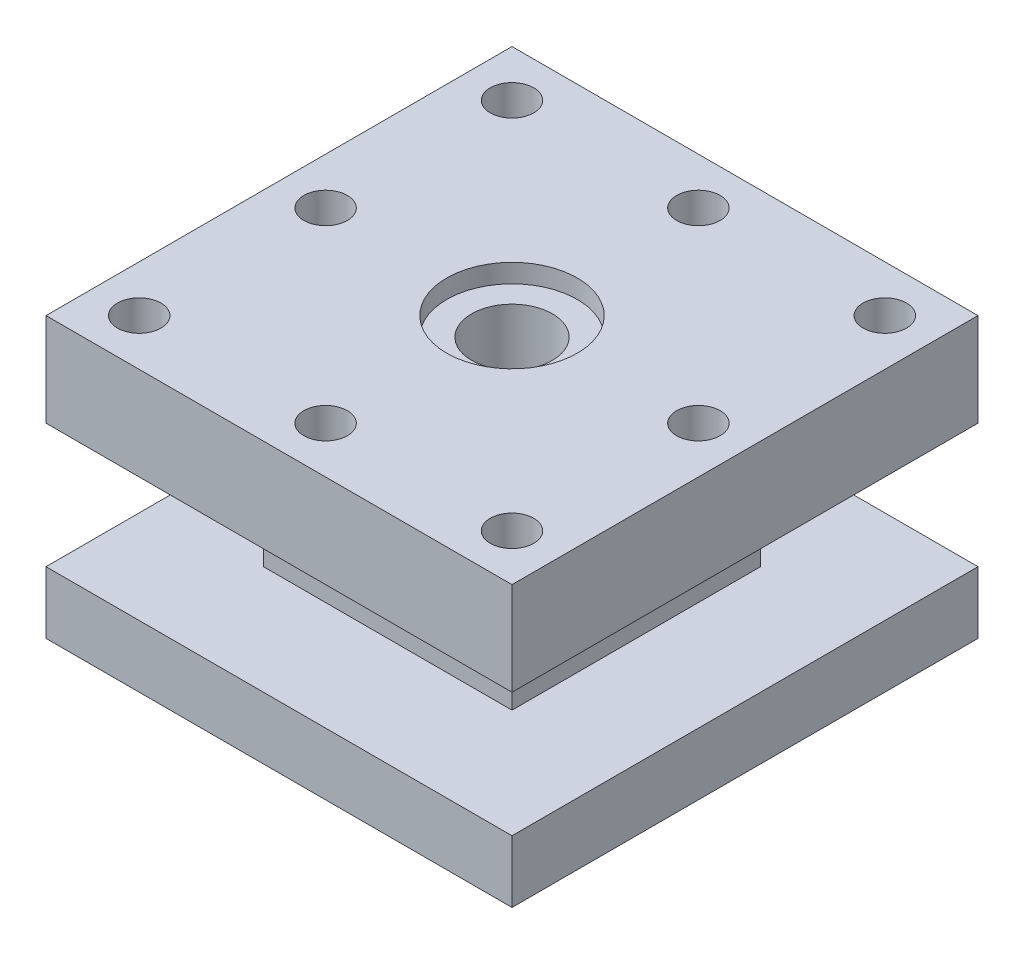
ISO-10303-21;
HEADER;
FILE_DESCRIPTION(('STEP AP214'),'2;1');
FILE_NAME('part.step','',(''),(''),'','','');
FILE_SCHEMA(('AUTOMOTIVE_DESIGN { 1 0 10303 214 1 1 1 1 }'));
ENDSEC;
DATA;
#1=APPLICATION_CONTEXT('core data for automotive mechanical design processes');
#2=APPLICATION_PROTOCOL_DEFINITION('international standard','automotive_design',2000,#1);
#3=PRODUCT_CONTEXT('',#1,'mechanical');
#4=PRODUCT('Part','Part','',(#3));
#5=PRODUCT_RELATED_PRODUCT_CATEGORY('part','',(#4));
#6=PRODUCT_DEFINITION_FORMATION('','',#4);
#7=PRODUCT_DEFINITION_CONTEXT('part definition',#1,'design');
#8=PRODUCT_DEFINITION('design','',#6,#7);
#9=PRODUCT_DEFINITION_SHAPE('','',#8);
#10=(LENGTH_UNIT() NAMED_UNIT(*) SI_UNIT(.MILLI.,.METRE.));
#11=(NAMED_UNIT(*) PLANE_ANGLE_UNIT() SI_UNIT($,.RADIAN.));
#12=(NAMED_UNIT(*) SI_UNIT($,.STERADIAN.) SOLID_ANGLE_UNIT());
#13=UNCERTAINTY_MEASURE_WITH_UNIT(LENGTH_MEASURE(1.E-05),#10,'distance_accuracy_value','');
#14=(GEOMETRIC_REPRESENTATION_CONTEXT(3) GLOBAL_UNCERTAINTY_ASSIGNED_CONTEXT((#13)) GLOBAL_UNIT_ASSIGNED_CONTEXT((#10,
#11,#12)) REPRESENTATION_CONTEXT('',''));
#15=CARTESIAN_POINT('',(0.,0.,0.));
#16=DIRECTION('',(0.,0.,1.));
#17=DIRECTION('',(1.,0.,0.));
#18=AXIS2_PLACEMENT_3D('',#15,#16,#17);
#19=CARTESIAN_POINT('',(0.,90.,0.));
#20=DIRECTION('',(0.,1.,0.));
#21=DIRECTION('',(0.,0.,1.));
#22=AXIS2_PLACEMENT_3D('',#19,#20,#21);
#23=PLANE('',#22);
#24=CARTESIAN_POINT('',(135.,90.,-75.));
#25=DIRECTION('',(0.,-1.,0.));
#26=DIRECTION('',(0.,0.,-1.));
#27=AXIS2_PLACEMENT_3D('',#24,#25,#26);
#28=CIRCLE('',#27,7.00000000000002);
#29=CARTESIAN_POINT('',(135.,90.,-82.));
#30=VERTEX_POINT('',#29);
#31=EDGE_CURVE('E258',#30,#30,#28,.T.);
#32=ORIENTED_EDGE('',*,*,#31,.T.);
#33=EDGE_LOOP('',(#32));
#34=FACE_BOUND('',#33,.T.);
#35=CARTESIAN_POINT('',(75.,90.,-15.));
#36=DIRECTION('',(0.,-1.,0.));
#37=DIRECTION('',(0.,0.,-1.));
#38=AXIS2_PLACEMENT_3D('',#35,#36,#37);
#39=CIRCLE('',#38,7.);
#40=CARTESIAN_POINT('',(75.,90.,-22.));
#41=VERTEX_POINT('',#40);
#42=EDGE_CURVE('E368',#41,#41,#39,.T.);
#43=ORIENTED_EDGE('',*,*,#42,.T.);
#44=EDGE_LOOP('',(#43));
#45=FACE_BOUND('',#44,.T.);
#46=CARTESIAN_POINT('',(75.,90.,-135.));
#47=DIRECTION('',(0.,1.,0.));
#48=DIRECTION('',(0.,0.,1.));
#49=AXIS2_PLACEMENT_3D('',#46,#47,#48);
#50=CIRCLE('',#49,7.00000000000002);
#51=CARTESIAN_POINT('',(75.,90.,-128.));
#52=VERTEX_POINT('',#51);
#53=EDGE_CURVE('E229',#52,#52,#50,.T.);
#54=ORIENTED_EDGE('',*,*,#53,.F.);
#55=EDGE_LOOP('',(#54));
#56=FACE_BOUND('',#55,.T.);
#57=CARTESIAN_POINT('',(75.,90.,-75.));
#58=DIRECTION('',(0.,1.,0.));
#59=DIRECTION('',(0.,0.,1.));
#60=AXIS2_PLACEMENT_3D('',#57,#58,#59);
#61=CIRCLE('',#60,21.);
#62=CARTESIAN_POINT('',(75.,90.,-54.));
#63=VERTEX_POINT('',#62);
#64=EDGE_CURVE('E223',#63,#63,#61,.T.);
#65=ORIENTED_EDGE('',*,*,#64,.F.);
#66=EDGE_LOOP('',(#65));
#67=FACE_BOUND('',#66,.T.);
#68=DIRECTION('',(0.,0.,1.));
#69=VECTOR('',#68,1.);
#70=CARTESIAN_POINT('',(0.,90.,-150.));
#71=LINE('',#70,#69);
#72=CARTESIAN_POINT('',(0.,90.,-150.));
#73=VERTEX_POINT('',#72);
#74=CARTESIAN_POINT('',(0.,90.,0.));
#75=VERTEX_POINT('',#74);
#76=EDGE_CURVE('E150',#73,#75,#71,.T.);
#77=ORIENTED_EDGE('',*,*,#76,.T.);
#78=DIRECTION('',(1.,0.,0.));
#79=VECTOR('',#78,1.);
#80=CARTESIAN_POINT('',(0.,90.,0.));
#81=LINE('',#80,#79);
#82=CARTESIAN_POINT('',(150.,90.,0.));
#83=VERTEX_POINT('',#82);
#84=EDGE_CURVE('E139',#75,#83,#81,.T.);
#85=ORIENTED_EDGE('',*,*,#84,.T.);
#86=DIRECTION('',(0.,0.,-1.));
#87=VECTOR('',#86,1.);
#88=CARTESIAN_POINT('',(150.,90.,-150.));
#89=LINE('',#88,#87);
#90=CARTESIAN_POINT('',(150.,90.,-150.));
#91=VERTEX_POINT('',#90);
#92=EDGE_CURVE('E149',#83,#91,#89,.T.);
#93=ORIENTED_EDGE('',*,*,#92,.T.);
#94=DIRECTION('',(-1.,0.,0.));
#95=VECTOR('',#94,1.);
#96=CARTESIAN_POINT('',(0.,90.,-150.));
#97=LINE('',#96,#95);
#98=EDGE_CURVE('E155',#91,#73,#97,.T.);
#99=ORIENTED_EDGE('',*,*,#98,.T.);
#100=EDGE_LOOP('',(#77,#85,#93,#99));
#101=FACE_BOUND('',#100,.T.);
#102=CARTESIAN_POINT('',(135.,90.,-135.));
#103=DIRECTION('',(0.,1.,0.));
#104=DIRECTION('',(0.,0.,1.));
#105=AXIS2_PLACEMENT_3D('',#102,#103,#104);
#106=CIRCLE('',#105,7.00000000000002);
#107=CARTESIAN_POINT('',(135.,90.,-128.));
#108=VERTEX_POINT('',#107);
#109=EDGE_CURVE('E371',#108,#108,#106,.T.);
#110=ORIENTED_EDGE('',*,*,#109,.F.);
#111=EDGE_LOOP('',(#110));
#112=FACE_BOUND('',#111,.T.);
#113=CARTESIAN_POINT('',(135.,90.,-15.));
#114=DIRECTION('',(0.,1.,0.));
#115=DIRECTION('',(0.,0.,1.));
#116=AXIS2_PLACEMENT_3D('',#113,#114,#115);
#117=CIRCLE('',#116,7.00000000000001);
#118=CARTESIAN_POINT('',(135.,90.,-7.99999999999997));
#119=VERTEX_POINT('',#118);
#120=EDGE_CURVE('E374',#119,#119,#117,.T.);
#121=ORIENTED_EDGE('',*,*,#120,.F.);
#122=EDGE_LOOP('',(#121));
#123=FACE_BOUND('',#122,.T.);
#124=CARTESIAN_POINT('',(15.,90.,-75.));
#125=DIRECTION('',(0.,1.,0.));
#126=DIRECTION('',(0.,0.,1.));
#127=AXIS2_PLACEMENT_3D('',#124,#125,#126);
#128=CIRCLE('',#127,7.);
#129=CARTESIAN_POINT('',(15.,90.,-68.));
#130=VERTEX_POINT('',#129);
#131=EDGE_CURVE('E234',#130,#130,#128,.T.);
#132=ORIENTED_EDGE('',*,*,#131,.F.);
#133=EDGE_LOOP('',(#132));
#134=FACE_BOUND('',#133,.T.);
#135=CARTESIAN_POINT('',(15.,90.,-135.));
#136=DIRECTION('',(0.,1.,0.));
#137=DIRECTION('',(0.,0.,1.));
#138=AXIS2_PLACEMENT_3D('',#135,#136,#137);
#139=CIRCLE('',#138,7.);
#140=CARTESIAN_POINT('',(15.,90.,-128.));
#141=VERTEX_POINT('',#140);
#142=EDGE_CURVE('E361',#141,#141,#139,.T.);
#143=ORIENTED_EDGE('',*,*,#142,.F.);
#144=EDGE_LOOP('',(#143));
#145=FACE_BOUND('',#144,.T.);
#146=CARTESIAN_POINT('',(15.,90.,-15.));
#147=DIRECTION('',(0.,1.,0.));
#148=DIRECTION('',(0.,0.,1.));
#149=AXIS2_PLACEMENT_3D('',#146,#147,#148);
#150=CIRCLE('',#149,7.);
#151=CARTESIAN_POINT('',(15.,90.,-7.99999999999998));
#152=VERTEX_POINT('',#151);
#153=EDGE_CURVE('E363',#152,#152,#150,.T.);
#154=ORIENTED_EDGE('',*,*,#153,.F.);
#155=EDGE_LOOP('',(#154));
#156=FACE_BOUND('',#155,.T.);
#157=ADVANCED_FACE('F37',(#34,#45,#56,#67,#101,#112,#123,#134,#145,#156),#23,.T.);
#158=CARTESIAN_POINT('',(0.,60.,0.));
#159=DIRECTION('',(0.,1.,0.));
#160=DIRECTION('',(0.,0.,1.));
#161=AXIS2_PLACEMENT_3D('',#158,#159,#160);
#162=PLANE('',#161);
#163=CARTESIAN_POINT('',(15.,60.,-135.));
#164=DIRECTION('',(0.,1.,0.));
#165=DIRECTION('',(0.,0.,1.));
#166=AXIS2_PLACEMENT_3D('',#163,#164,#165);
#167=CIRCLE('',#166,7.);
#168=CARTESIAN_POINT('',(15.,60.,-128.));
#169=VERTEX_POINT('',#168);
#170=EDGE_CURVE('E245',#169,#169,#167,.T.);
#171=ORIENTED_EDGE('',*,*,#170,.T.);
#172=EDGE_LOOP('',(#171));
#173=FACE_BOUND('',#172,.T.);
#174=CARTESIAN_POINT('',(135.,60.,-15.));
#175=DIRECTION('',(0.,1.,0.));
#176=DIRECTION('',(0.,0.,1.));
#177=AXIS2_PLACEMENT_3D('',#174,#175,#176);
#178=CIRCLE('',#177,7.00000000000001);
#179=CARTESIAN_POINT('',(135.,60.,-7.99999999999997));
#180=VERTEX_POINT('',#179);
#181=EDGE_CURVE('E240',#180,#180,#178,.T.);
#182=ORIENTED_EDGE('',*,*,#181,.T.);
#183=EDGE_LOOP('',(#182));
#184=FACE_BOUND('',#183,.T.);
#185=DIRECTION('',(0.,0.,1.));
#186=VECTOR('',#185,1.);
#187=CARTESIAN_POINT('',(0.,60.,-150.));
#188=LINE('',#187,#186);
#189=CARTESIAN_POINT('',(0.,60.,-150.));
#190=VERTEX_POINT('',#189);
#191=CARTESIAN_POINT('',(0.,60.,0.));
#192=VERTEX_POINT('',#191);
#193=EDGE_CURVE('E163',#190,#192,#188,.T.);
#194=ORIENTED_EDGE('',*,*,#193,.F.);
#195=DIRECTION('',(-1.,0.,0.));
#196=VECTOR('',#195,1.);
#197=CARTESIAN_POINT('',(0.,60.,-150.));
#198=LINE('',#197,#196);
#199=CARTESIAN_POINT('',(150.,60.,-150.));
#200=VERTEX_POINT('',#199);
#201=EDGE_CURVE('E159',#200,#190,#198,.T.);
#202=ORIENTED_EDGE('',*,*,#201,.F.);
#203=DIRECTION('',(0.,0.,-1.));
#204=VECTOR('',#203,1.);
#205=CARTESIAN_POINT('',(150.,60.,-150.));
#206=LINE('',#205,#204);
#207=CARTESIAN_POINT('',(150.,60.,0.));
#208=VERTEX_POINT('',#207);
#209=EDGE_CURVE('E274',#208,#200,#206,.T.);
#210=ORIENTED_EDGE('',*,*,#209,.F.);
#211=DIRECTION('',(1.,0.,0.));
#212=VECTOR('',#211,1.);
#213=CARTESIAN_POINT('',(0.,60.,0.));
#214=LINE('',#213,#212);
#215=EDGE_CURVE('E272',#192,#208,#214,.T.);
#216=ORIENTED_EDGE('',*,*,#215,.F.);
#217=EDGE_LOOP('',(#194,#202,#210,#216));
#218=FACE_BOUND('',#217,.T.);
#219=DIRECTION('',(0.,0.,-1.));
#220=VECTOR('',#219,1.);
#221=CARTESIAN_POINT('',(35.,60.,-35.));
#222=LINE('',#221,#220);
#223=CARTESIAN_POINT('',(35.,60.,-35.));
#224=VERTEX_POINT('',#223);
#225=CARTESIAN_POINT('',(35.,60.,-115.));
#226=VERTEX_POINT('',#225);
#227=EDGE_CURVE('E173',#224,#226,#222,.T.);
#228=ORIENTED_EDGE('',*,*,#227,.F.);
#229=DIRECTION('',(1.,0.,0.));
#230=VECTOR('',#229,1.);
#231=CARTESIAN_POINT('',(35.,60.,-35.));
#232=LINE('',#231,#230);
#233=CARTESIAN_POINT('',(115.,60.,-35.));
#234=VERTEX_POINT('',#233);
#235=EDGE_CURVE('E182',#224,#234,#232,.T.);
#236=ORIENTED_EDGE('',*,*,#235,.T.);
#237=DIRECTION('',(0.,0.,-1.));
#238=VECTOR('',#237,1.);
#239=CARTESIAN_POINT('',(115.,60.,-35.));
#240=LINE('',#239,#238);
#241=CARTESIAN_POINT('',(115.,60.,-115.));
#242=VERTEX_POINT('',#241);
#243=EDGE_CURVE('E180',#234,#242,#240,.T.);
#244=ORIENTED_EDGE('',*,*,#243,.T.);
#245=DIRECTION('',(1.,0.,0.));
#246=VECTOR('',#245,1.);
#247=CARTESIAN_POINT('',(35.,60.,-115.));
#248=LINE('',#247,#246);
#249=EDGE_CURVE('E176',#226,#242,#248,.T.);
#250=ORIENTED_EDGE('',*,*,#249,.F.);
#251=EDGE_LOOP('',(#228,#236,#244,#250));
#252=FACE_BOUND('',#251,.T.);
#253=CARTESIAN_POINT('',(75.,60.,-135.));
#254=DIRECTION('',(0.,1.,0.));
#255=DIRECTION('',(0.,0.,1.));
#256=AXIS2_PLACEMENT_3D('',#253,#254,#255);
#257=CIRCLE('',#256,7.00000000000002);
#258=CARTESIAN_POINT('',(75.,60.,-128.));
#259=VERTEX_POINT('',#258);
#260=EDGE_CURVE('E225',#259,#259,#257,.T.);
#261=ORIENTED_EDGE('',*,*,#260,.T.);
#262=EDGE_LOOP('',(#261));
#263=FACE_BOUND('',#262,.T.);
#264=CARTESIAN_POINT('',(75.,60.,-15.));
#265=DIRECTION('',(0.,1.,0.));
#266=DIRECTION('',(0.,0.,1.));
#267=AXIS2_PLACEMENT_3D('',#264,#265,#266);
#268=CIRCLE('',#267,7.);
#269=CARTESIAN_POINT('',(75.,60.,-7.99999999999998));
#270=VERTEX_POINT('',#269);
#271=EDGE_CURVE('E230',#270,#270,#268,.F.);
#272=ORIENTED_EDGE('',*,*,#271,.F.);
#273=EDGE_LOOP('',(#272));
#274=FACE_BOUND('',#273,.T.);
#275=CARTESIAN_POINT('',(135.,60.,-75.));
#276=DIRECTION('',(0.,1.,0.));
#277=DIRECTION('',(0.,0.,1.));
#278=AXIS2_PLACEMENT_3D('',#275,#276,#277);
#279=CIRCLE('',#278,7.00000000000002);
#280=CARTESIAN_POINT('',(135.,60.,-68.));
#281=VERTEX_POINT('',#280);
#282=EDGE_CURVE('E233',#281,#281,#279,.F.);
#283=ORIENTED_EDGE('',*,*,#282,.F.);
#284=EDGE_LOOP('',(#283));
#285=FACE_BOUND('',#284,.T.);
#286=CARTESIAN_POINT('',(135.,60.,-135.));
#287=DIRECTION('',(0.,1.,0.));
#288=DIRECTION('',(0.,0.,1.));
#289=AXIS2_PLACEMENT_3D('',#286,#287,#288);
#290=CIRCLE('',#289,7.00000000000002);
#291=CARTESIAN_POINT('',(135.,60.,-128.));
#292=VERTEX_POINT('',#291);
#293=EDGE_CURVE('E237',#292,#292,#290,.T.);
#294=ORIENTED_EDGE('',*,*,#293,.T.);
#295=EDGE_LOOP('',(#294));
#296=FACE_BOUND('',#295,.T.);
#297=CARTESIAN_POINT('',(15.,60.,-75.));
#298=DIRECTION('',(0.,1.,0.));
#299=DIRECTION('',(0.,0.,1.));
#300=AXIS2_PLACEMENT_3D('',#297,#298,#299);
#301=CIRCLE('',#300,7.);
#302=CARTESIAN_POINT('',(15.,60.,-68.));
#303=VERTEX_POINT('',#302);
#304=EDGE_CURVE('E243',#303,#303,#301,.T.);
#305=ORIENTED_EDGE('',*,*,#304,.T.);
#306=EDGE_LOOP('',(#305));
#307=FACE_BOUND('',#306,.T.);
#308=CARTESIAN_POINT('',(15.,60.,-15.));
#309=DIRECTION('',(0.,1.,0.));
#310=DIRECTION('',(0.,0.,1.));
#311=AXIS2_PLACEMENT_3D('',#308,#309,#310);
#312=CIRCLE('',#311,7.);
#313=CARTESIAN_POINT('',(15.,60.,-7.99999999999998));
#314=VERTEX_POINT('',#313);
#315=EDGE_CURVE('E41',#314,#314,#312,.T.);
#316=ORIENTED_EDGE('',*,*,#315,.T.);
#317=EDGE_LOOP('',(#316));
#318=FACE_BOUND('',#317,.T.);
#319=ADVANCED_FACE('F285',(#173,#184,#218,#252,#263,#274,#285,#296,#307,#318),#162,.F.);
#320=CARTESIAN_POINT('',(75.,-78.,-75.));
#321=DIRECTION('',(0.,1.,0.));
#322=DIRECTION('',(0.,0.,1.));
#323=AXIS2_PLACEMENT_3D('',#320,#321,#322);
#324=CYLINDRICAL_SURFACE('',#323,13.);
#325=CARTESIAN_POINT('',(75.,84.,-75.));
#326=DIRECTION('',(0.,1.,0.));
#327=DIRECTION('',(0.,0.,1.));
#328=AXIS2_PLACEMENT_3D('',#325,#326,#327);
#329=CIRCLE('',#328,13.);
#330=CARTESIAN_POINT('',(75.,84.,-62.));
#331=VERTEX_POINT('',#330);
#332=EDGE_CURVE('E216',#331,#331,#329,.F.);
#333=ORIENTED_EDGE('',*,*,#332,.F.);
#334=EDGE_LOOP('',(#333));
#335=FACE_BOUND('',#334,.T.);
#336=CARTESIAN_POINT('',(75.,12.,-75.));
#337=DIRECTION('',(0.,-1.,0.));
#338=DIRECTION('',(0.,0.,-1.));
#339=AXIS2_PLACEMENT_3D('',#336,#337,#338);
#340=CIRCLE('',#339,13.);
#341=CARTESIAN_POINT('',(75.,12.,-88.));
#342=VERTEX_POINT('',#341);
#343=EDGE_CURVE('E220',#342,#342,#340,.F.);
#344=ORIENTED_EDGE('',*,*,#343,.F.);
#345=EDGE_LOOP('',(#344));
#346=FACE_BOUND('',#345,.T.);
#347=ADVANCED_FACE('F303',(#335,#346),#324,.F.);
#348=CARTESIAN_POINT('',(0.,20.,0.));
#349=DIRECTION('',(1.,0.,0.));
#350=DIRECTION('',(0.,0.,-1.));
#351=AXIS2_PLACEMENT_3D('',#348,#349,#350);
#352=PLANE('',#351);
#353=DIRECTION('',(0.,0.,1.));
#354=VECTOR('',#353,1.);
#355=CARTESIAN_POINT('',(0.,0.,0.));
#356=LINE('',#355,#354);
#357=CARTESIAN_POINT('',(0.,0.,-150.));
#358=VERTEX_POINT('',#357);
#359=CARTESIAN_POINT('',(0.,0.,0.));
#360=VERTEX_POINT('',#359);
#361=EDGE_CURVE('E191',#358,#360,#356,.T.);
#362=ORIENTED_EDGE('',*,*,#361,.T.);
#363=DIRECTION('',(0.,-1.,0.));
#364=VECTOR('',#363,1.);
#365=CARTESIAN_POINT('',(0.,20.,0.));
#366=LINE('',#365,#364);
#367=CARTESIAN_POINT('',(0.,20.,0.));
#368=VERTEX_POINT('',#367);
#369=EDGE_CURVE('E11',#368,#360,#366,.T.);
#370=ORIENTED_EDGE('',*,*,#369,.F.);
#371=DIRECTION('',(0.,0.,1.));
#372=VECTOR('',#371,1.);
#373=CARTESIAN_POINT('',(0.,20.,0.));
#374=LINE('',#373,#372);
#375=CARTESIAN_POINT('',(0.,20.,-150.));
#376=VERTEX_POINT('',#375);
#377=EDGE_CURVE('E197',#376,#368,#374,.T.);
#378=ORIENTED_EDGE('',*,*,#377,.F.);
#379=DIRECTION('',(0.,-1.,0.));
#380=VECTOR('',#379,1.);
#381=CARTESIAN_POINT('',(0.,20.,-150.));
#382=LINE('',#381,#380);
#383=EDGE_CURVE('E203',#376,#358,#382,.T.);
#384=ORIENTED_EDGE('',*,*,#383,.T.);
#385=EDGE_LOOP('',(#362,#370,#378,#384));
#386=FACE_BOUND('',#385,.T.);
#387=ADVANCED_FACE('F39',(#386),#352,.F.);
#388=CARTESIAN_POINT('',(0.,20.,0.));
#389=DIRECTION('',(0.,0.,-1.));
#390=DIRECTION('',(-1.,0.,0.));
#391=AXIS2_PLACEMENT_3D('',#388,#389,#390);
#392=PLANE('',#391);
#393=DIRECTION('',(1.,0.,0.));
#394=VECTOR('',#393,1.);
#395=CARTESIAN_POINT('',(0.,0.,0.));
#396=LINE('',#395,#394);
#397=CARTESIAN_POINT('',(150.,0.,0.));
#398=VERTEX_POINT('',#397);
#399=EDGE_CURVE('E206',#360,#398,#396,.T.);
#400=ORIENTED_EDGE('',*,*,#399,.T.);
#401=DIRECTION('',(0.,-1.,0.));
#402=VECTOR('',#401,1.);
#403=CARTESIAN_POINT('',(150.,20.,0.));
#404=LINE('',#403,#402);
#405=CARTESIAN_POINT('',(150.,20.,0.));
#406=VERTEX_POINT('',#405);
#407=EDGE_CURVE('E46',#406,#398,#404,.T.);
#408=ORIENTED_EDGE('',*,*,#407,.F.);
#409=DIRECTION('',(1.,0.,0.));
#410=VECTOR('',#409,1.);
#411=CARTESIAN_POINT('',(0.,20.,0.));
#412=LINE('',#411,#410);
#413=EDGE_CURVE('E91',#368,#406,#412,.T.);
#414=ORIENTED_EDGE('',*,*,#413,.F.);
#415=ORIENTED_EDGE('',*,*,#369,.T.);
#416=EDGE_LOOP('',(#400,#408,#414,#415));
#417=FACE_BOUND('',#416,.T.);
#418=ADVANCED_FACE('F570',(#417),#392,.F.);
#419=CARTESIAN_POINT('',(150.,20.,0.));
#420=DIRECTION('',(-1.,0.,0.));
#421=DIRECTION('',(0.,0.,1.));
#422=AXIS2_PLACEMENT_3D('',#419,#420,#421);
#423=PLANE('',#422);
#424=DIRECTION('',(0.,0.,-1.));
#425=VECTOR('',#424,1.);
#426=CARTESIAN_POINT('',(150.,0.,0.));
#427=LINE('',#426,#425);
#428=CARTESIAN_POINT('',(150.,0.,-150.));
#429=VERTEX_POINT('',#428);
#430=EDGE_CURVE('E208',#398,#429,#427,.T.);
#431=ORIENTED_EDGE('',*,*,#430,.T.);
#432=DIRECTION('',(0.,-1.,0.));
#433=VECTOR('',#432,1.);
#434=CARTESIAN_POINT('',(150.,20.,-150.));
#435=LINE('',#434,#433);
#436=CARTESIAN_POINT('',(150.,20.,-150.));
#437=VERTEX_POINT('',#436);
#438=EDGE_CURVE('E212',#437,#429,#435,.T.);
#439=ORIENTED_EDGE('',*,*,#438,.F.);
#440=DIRECTION('',(0.,0.,-1.));
#441=VECTOR('',#440,1.);
#442=CARTESIAN_POINT('',(150.,20.,0.));
#443=LINE('',#442,#441);
#444=EDGE_CURVE('E200',#406,#437,#443,.T.);
#445=ORIENTED_EDGE('',*,*,#444,.F.);
#446=ORIENTED_EDGE('',*,*,#407,.T.);
#447=EDGE_LOOP('',(#431,#439,#445,#446));
#448=FACE_BOUND('',#447,.T.);
#449=ADVANCED_FACE('F562',(#448),#423,.F.);
#450=CARTESIAN_POINT('',(0.,20.,-150.));
#451=DIRECTION('',(0.,0.,1.));
#452=DIRECTION('',(1.,0.,0.));
#453=AXIS2_PLACEMENT_3D('',#450,#451,#452);
#454=PLANE('',#453);
#455=DIRECTION('',(-1.,0.,0.));
#456=VECTOR('',#455,1.);
#457=CARTESIAN_POINT('',(0.,0.,-150.));
#458=LINE('',#457,#456);
#459=EDGE_CURVE('E84',#429,#358,#458,.T.);
#460=ORIENTED_EDGE('',*,*,#459,.T.);
#461=ORIENTED_EDGE('',*,*,#383,.F.);
#462=DIRECTION('',(-1.,0.,0.));
#463=VECTOR('',#462,1.);
#464=CARTESIAN_POINT('',(0.,20.,-150.));
#465=LINE('',#464,#463);
#466=EDGE_CURVE('E63',#437,#376,#465,.T.);
#467=ORIENTED_EDGE('',*,*,#466,.F.);
#468=ORIENTED_EDGE('',*,*,#438,.T.);
#469=EDGE_LOOP('',(#460,#461,#467,#468));
#470=FACE_BOUND('',#469,.T.);
#471=ADVANCED_FACE('F553',(#470),#454,.F.);
#472=CARTESIAN_POINT('',(0.,20.,0.));
#473=DIRECTION('',(0.,-1.,0.));
#474=DIRECTION('',(0.,0.,-1.));
#475=AXIS2_PLACEMENT_3D('',#472,#473,#474);
#476=PLANE('',#475);
#477=DIRECTION('',(1.,0.,0.));
#478=VECTOR('',#477,1.);
#479=CARTESIAN_POINT('',(35.,20.,-35.));
#480=LINE('',#479,#478);
#481=CARTESIAN_POINT('',(35.,20.,-35.));
#482=VERTEX_POINT('',#481);
#483=CARTESIAN_POINT('',(115.,20.,-35.));
#484=VERTEX_POINT('',#483);
#485=EDGE_CURVE('E177',#482,#484,#480,.T.);
#486=ORIENTED_EDGE('',*,*,#485,.F.);
#487=DIRECTION('',(0.,0.,-1.));
#488=VECTOR('',#487,1.);
#489=CARTESIAN_POINT('',(35.,20.,-35.));
#490=LINE('',#489,#488);
#491=CARTESIAN_POINT('',(35.,20.,-115.));
#492=VERTEX_POINT('',#491);
#493=EDGE_CURVE('E164',#482,#492,#490,.T.);
#494=ORIENTED_EDGE('',*,*,#493,.T.);
#495=DIRECTION('',(1.,0.,0.));
#496=VECTOR('',#495,1.);
#497=CARTESIAN_POINT('',(35.,20.,-115.));
#498=LINE('',#497,#496);
#499=CARTESIAN_POINT('',(115.,20.,-115.));
#500=VERTEX_POINT('',#499);
#501=EDGE_CURVE('E167',#492,#500,#498,.T.);
#502=ORIENTED_EDGE('',*,*,#501,.T.);
#503=DIRECTION('',(0.,0.,-1.));
#504=VECTOR('',#503,1.);
#505=CARTESIAN_POINT('',(115.,20.,-35.));
#506=LINE('',#505,#504);
#507=EDGE_CURVE('E54',#484,#500,#506,.T.);
#508=ORIENTED_EDGE('',*,*,#507,.F.);
#509=EDGE_LOOP('',(#486,#494,#502,#508));
#510=FACE_BOUND('',#509,.T.);
#511=ORIENTED_EDGE('',*,*,#377,.T.);
#512=ORIENTED_EDGE('',*,*,#413,.T.);
#513=ORIENTED_EDGE('',*,*,#444,.T.);
#514=ORIENTED_EDGE('',*,*,#466,.T.);
#515=EDGE_LOOP('',(#511,#512,#513,#514));
#516=FACE_BOUND('',#515,.T.);
#517=ADVANCED_FACE('F545',(#510,#516),#476,.F.);
#518=CARTESIAN_POINT('',(0.,0.,0.));
#519=DIRECTION('',(0.,-1.,0.));
#520=DIRECTION('',(0.,0.,-1.));
#521=AXIS2_PLACEMENT_3D('',#518,#519,#520);
#522=PLANE('',#521);
#523=CARTESIAN_POINT('',(75.,0.,-75.));
#524=DIRECTION('',(0.,-1.,0.));
#525=DIRECTION('',(0.,0.,-1.));
#526=AXIS2_PLACEMENT_3D('',#523,#524,#525);
#527=CIRCLE('',#526,32.);
#528=CARTESIAN_POINT('',(75.,0.,-107.));
#529=VERTEX_POINT('',#528);
#530=EDGE_CURVE('E228',#529,#529,#527,.T.);
#531=ORIENTED_EDGE('',*,*,#530,.F.);
#532=EDGE_LOOP('',(#531));
#533=FACE_BOUND('',#532,.T.);
#534=ORIENTED_EDGE('',*,*,#361,.F.);
#535=ORIENTED_EDGE('',*,*,#459,.F.);
#536=ORIENTED_EDGE('',*,*,#430,.F.);
#537=ORIENTED_EDGE('',*,*,#399,.F.);
#538=EDGE_LOOP('',(#534,#535,#536,#537));
#539=FACE_BOUND('',#538,.T.);
#540=ADVANCED_FACE('F536',(#533,#539),#522,.T.);
#541=CARTESIAN_POINT('',(35.,60.,-35.));
#542=DIRECTION('',(-1.,0.,0.));
#543=DIRECTION('',(0.,0.,1.));
#544=AXIS2_PLACEMENT_3D('',#541,#542,#543);
#545=PLANE('',#544);
#546=ORIENTED_EDGE('',*,*,#493,.F.);
#547=DIRECTION('',(0.,-1.,0.));
#548=VECTOR('',#547,1.);
#549=CARTESIAN_POINT('',(35.,60.,-35.));
#550=LINE('',#549,#548);
#551=EDGE_CURVE('E189',#224,#482,#550,.T.);
#552=ORIENTED_EDGE('',*,*,#551,.F.);
#553=ORIENTED_EDGE('',*,*,#227,.T.);
#554=DIRECTION('',(0.,-1.,0.));
#555=VECTOR('',#554,1.);
#556=CARTESIAN_POINT('',(35.,60.,-115.));
#557=LINE('',#556,#555);
#558=EDGE_CURVE('E183',#226,#492,#557,.T.);
#559=ORIENTED_EDGE('',*,*,#558,.T.);
#560=EDGE_LOOP('',(#546,#552,#553,#559));
#561=FACE_BOUND('',#560,.T.);
#562=ADVANCED_FACE('F527',(#561),#545,.T.);
#563=CARTESIAN_POINT('',(35.,60.,-35.));
#564=DIRECTION('',(0.,0.,-1.));
#565=DIRECTION('',(-1.,0.,0.));
#566=AXIS2_PLACEMENT_3D('',#563,#564,#565);
#567=PLANE('',#566);
#568=ORIENTED_EDGE('',*,*,#485,.T.);
#569=DIRECTION('',(0.,-1.,0.));
#570=VECTOR('',#569,1.);
#571=CARTESIAN_POINT('',(115.,60.,-35.));
#572=LINE('',#571,#570);
#573=EDGE_CURVE('E192',#234,#484,#572,.T.);
#574=ORIENTED_EDGE('',*,*,#573,.F.);
#575=ORIENTED_EDGE('',*,*,#235,.F.);
#576=ORIENTED_EDGE('',*,*,#551,.T.);
#577=EDGE_LOOP('',(#568,#574,#575,#576));
#578=FACE_BOUND('',#577,.T.);
#579=ADVANCED_FACE('F519',(#578),#567,.F.);
#580=CARTESIAN_POINT('',(115.,60.,-35.));
#581=DIRECTION('',(-1.,0.,0.));
#582=DIRECTION('',(0.,0.,1.));
#583=AXIS2_PLACEMENT_3D('',#580,#581,#582);
#584=PLANE('',#583);
#585=ORIENTED_EDGE('',*,*,#507,.T.);
#586=DIRECTION('',(0.,-1.,0.));
#587=VECTOR('',#586,1.);
#588=CARTESIAN_POINT('',(115.,60.,-115.));
#589=LINE('',#588,#587);
#590=EDGE_CURVE('E194',#242,#500,#589,.T.);
#591=ORIENTED_EDGE('',*,*,#590,.F.);
#592=ORIENTED_EDGE('',*,*,#243,.F.);
#593=ORIENTED_EDGE('',*,*,#573,.T.);
#594=EDGE_LOOP('',(#585,#591,#592,#593));
#595=FACE_BOUND('',#594,.T.);
#596=ADVANCED_FACE('F510',(#595),#584,.F.);
#597=CARTESIAN_POINT('',(35.,60.,-115.));
#598=DIRECTION('',(0.,0.,-1.));
#599=DIRECTION('',(-1.,0.,0.));
#600=AXIS2_PLACEMENT_3D('',#597,#598,#599);
#601=PLANE('',#600);
#602=ORIENTED_EDGE('',*,*,#501,.F.);
#603=ORIENTED_EDGE('',*,*,#558,.F.);
#604=ORIENTED_EDGE('',*,*,#249,.T.);
#605=ORIENTED_EDGE('',*,*,#590,.T.);
#606=EDGE_LOOP('',(#602,#603,#604,#605));
#607=FACE_BOUND('',#606,.T.);
#608=ADVANCED_FACE('F502',(#607),#601,.T.);
#609=CARTESIAN_POINT('',(0.,90.,-150.));
#610=DIRECTION('',(1.,0.,0.));
#611=DIRECTION('',(0.,0.,-1.));
#612=AXIS2_PLACEMENT_3D('',#609,#610,#611);
#613=PLANE('',#612);
#614=ORIENTED_EDGE('',*,*,#193,.T.);
#615=DIRECTION('',(0.,-1.,0.));
#616=VECTOR('',#615,1.);
#617=CARTESIAN_POINT('',(0.,90.,0.));
#618=LINE('',#617,#616);
#619=EDGE_CURVE('E143',#75,#192,#618,.T.);
#620=ORIENTED_EDGE('',*,*,#619,.F.);
#621=ORIENTED_EDGE('',*,*,#76,.F.);
#622=DIRECTION('',(0.,-1.,0.));
#623=VECTOR('',#622,1.);
#624=CARTESIAN_POINT('',(0.,90.,-150.));
#625=LINE('',#624,#623);
#626=EDGE_CURVE('E270',#73,#190,#625,.T.);
#627=ORIENTED_EDGE('',*,*,#626,.T.);
#628=EDGE_LOOP('',(#614,#620,#621,#627));
#629=FACE_BOUND('',#628,.T.);
#630=ADVANCED_FACE('F161',(#629),#613,.F.);
#631=CARTESIAN_POINT('',(0.,90.,0.));
#632=DIRECTION('',(0.,0.,-1.));
#633=DIRECTION('',(-1.,0.,0.));
#634=AXIS2_PLACEMENT_3D('',#631,#632,#633);
#635=PLANE('',#634);
#636=ORIENTED_EDGE('',*,*,#215,.T.);
#637=DIRECTION('',(0.,-1.,0.));
#638=VECTOR('',#637,1.);
#639=CARTESIAN_POINT('',(150.,90.,0.));
#640=LINE('',#639,#638);
#641=EDGE_CURVE('E146',#83,#208,#640,.T.);
#642=ORIENTED_EDGE('',*,*,#641,.F.);
#643=ORIENTED_EDGE('',*,*,#84,.F.);
#644=ORIENTED_EDGE('',*,*,#619,.T.);
#645=EDGE_LOOP('',(#636,#642,#643,#644));
#646=FACE_BOUND('',#645,.T.);
#647=ADVANCED_FACE('F141',(#646),#635,.F.);
#648=CARTESIAN_POINT('',(150.,90.,-150.));
#649=DIRECTION('',(-1.,0.,0.));
#650=DIRECTION('',(0.,0.,1.));
#651=AXIS2_PLACEMENT_3D('',#648,#649,#650);
#652=PLANE('',#651);
#653=ORIENTED_EDGE('',*,*,#209,.T.);
#654=DIRECTION('',(0.,-1.,0.));
#655=VECTOR('',#654,1.);
#656=CARTESIAN_POINT('',(150.,90.,-150.));
#657=LINE('',#656,#655);
#658=EDGE_CURVE('E169',#91,#200,#657,.T.);
#659=ORIENTED_EDGE('',*,*,#658,.F.);
#660=ORIENTED_EDGE('',*,*,#92,.F.);
#661=ORIENTED_EDGE('',*,*,#641,.T.);
#662=EDGE_LOOP('',(#653,#659,#660,#661));
#663=FACE_BOUND('',#662,.T.);
#664=ADVANCED_FACE('F287',(#663),#652,.F.);
#665=CARTESIAN_POINT('',(0.,90.,-150.));
#666=DIRECTION('',(0.,0.,1.));
#667=DIRECTION('',(1.,0.,0.));
#668=AXIS2_PLACEMENT_3D('',#665,#666,#667);
#669=PLANE('',#668);
#670=ORIENTED_EDGE('',*,*,#201,.T.);
#671=ORIENTED_EDGE('',*,*,#626,.F.);
#672=ORIENTED_EDGE('',*,*,#98,.F.);
#673=ORIENTED_EDGE('',*,*,#658,.T.);
#674=EDGE_LOOP('',(#670,#671,#672,#673));
#675=FACE_BOUND('',#674,.T.);
#676=ADVANCED_FACE('F281',(#675),#669,.F.);
#677=CARTESIAN_POINT('',(75.,84.,-75.));
#678=DIRECTION('',(0.,1.,0.));
#679=DIRECTION('',(0.,0.,1.));
#680=AXIS2_PLACEMENT_3D('',#677,#678,#679);
#681=PLANE('',#680);
#682=CARTESIAN_POINT('',(75.,84.,-75.));
#683=DIRECTION('',(0.,1.,0.));
#684=DIRECTION('',(0.,0.,1.));
#685=AXIS2_PLACEMENT_3D('',#682,#683,#684);
#686=CIRCLE('',#685,21.);
#687=CARTESIAN_POINT('',(75.,84.,-54.));
#688=VERTEX_POINT('',#687);
#689=EDGE_CURVE('E219',#688,#688,#686,.T.);
#690=ORIENTED_EDGE('',*,*,#689,.T.);
#691=EDGE_LOOP('',(#690));
#692=FACE_BOUND('',#691,.T.);
#693=ORIENTED_EDGE('',*,*,#332,.T.);
#694=EDGE_LOOP('',(#693));
#695=FACE_BOUND('',#694,.T.);
#696=ADVANCED_FACE('F294',(#692,#695),#681,.T.);
#697=CARTESIAN_POINT('',(75.,84.,-75.));
#698=DIRECTION('',(0.,1.,0.));
#699=DIRECTION('',(0.,0.,1.));
#700=AXIS2_PLACEMENT_3D('',#697,#698,#699);
#701=CYLINDRICAL_SURFACE('',#700,21.);
#702=ORIENTED_EDGE('',*,*,#689,.F.);
#703=EDGE_LOOP('',(#702));
#704=FACE_BOUND('',#703,.T.);
#705=ORIENTED_EDGE('',*,*,#64,.T.);
#706=EDGE_LOOP('',(#705));
#707=FACE_BOUND('',#706,.T.);
#708=ADVANCED_FACE('F311',(#704,#707),#701,.F.);
#709=CARTESIAN_POINT('',(75.,12.,-75.));
#710=DIRECTION('',(0.,-1.,0.));
#711=DIRECTION('',(0.,0.,-1.));
#712=AXIS2_PLACEMENT_3D('',#709,#710,#711);
#713=PLANE('',#712);
#714=CARTESIAN_POINT('',(75.,12.,-75.));
#715=DIRECTION('',(0.,-1.,0.));
#716=DIRECTION('',(0.,0.,-1.));
#717=AXIS2_PLACEMENT_3D('',#714,#715,#716);
#718=CIRCLE('',#717,32.);
#719=CARTESIAN_POINT('',(75.,12.,-107.));
#720=VERTEX_POINT('',#719);
#721=EDGE_CURVE('E224',#720,#720,#718,.T.);
#722=ORIENTED_EDGE('',*,*,#721,.T.);
#723=EDGE_LOOP('',(#722));
#724=FACE_BOUND('',#723,.T.);
#725=ORIENTED_EDGE('',*,*,#343,.T.);
#726=EDGE_LOOP('',(#725));
#727=FACE_BOUND('',#726,.T.);
#728=ADVANCED_FACE('F314',(#724,#727),#713,.T.);
#729=CARTESIAN_POINT('',(75.,12.,-75.));
#730=DIRECTION('',(0.,-1.,0.));
#731=DIRECTION('',(0.,0.,-1.));
#732=AXIS2_PLACEMENT_3D('',#729,#730,#731);
#733=CYLINDRICAL_SURFACE('',#732,32.);
#734=ORIENTED_EDGE('',*,*,#721,.F.);
#735=EDGE_LOOP('',(#734));
#736=FACE_BOUND('',#735,.T.);
#737=ORIENTED_EDGE('',*,*,#530,.T.);
#738=EDGE_LOOP('',(#737));
#739=FACE_BOUND('',#738,.T.);
#740=ADVANCED_FACE('F319',(#736,#739),#733,.F.);
#741=CARTESIAN_POINT('',(75.,38.,-135.));
#742=DIRECTION('',(0.,1.,0.));
#743=DIRECTION('',(0.,0.,1.));
#744=AXIS2_PLACEMENT_3D('',#741,#742,#743);
#745=CYLINDRICAL_SURFACE('',#744,7.00000000000002);
#746=ORIENTED_EDGE('',*,*,#53,.T.);
#747=EDGE_LOOP('',(#746));
#748=FACE_BOUND('',#747,.T.);
#749=ORIENTED_EDGE('',*,*,#260,.F.);
#750=EDGE_LOOP('',(#749));
#751=FACE_BOUND('',#750,.T.);
#752=ADVANCED_FACE('F322',(#748,#751),#745,.F.);
#753=CARTESIAN_POINT('',(75.,38.,-15.));
#754=DIRECTION('',(0.,1.,0.));
#755=DIRECTION('',(0.,0.,1.));
#756=AXIS2_PLACEMENT_3D('',#753,#754,#755);
#757=CYLINDRICAL_SURFACE('',#756,7.);
#758=ORIENTED_EDGE('',*,*,#42,.F.);
#759=EDGE_LOOP('',(#758));
#760=FACE_BOUND('',#759,.T.);
#761=ORIENTED_EDGE('',*,*,#271,.T.);
#762=EDGE_LOOP('',(#761));
#763=FACE_BOUND('',#762,.T.);
#764=ADVANCED_FACE('F329',(#760,#763),#757,.F.);
#765=CARTESIAN_POINT('',(135.,38.,-75.));
#766=DIRECTION('',(0.,1.,0.));
#767=DIRECTION('',(0.,0.,1.));
#768=AXIS2_PLACEMENT_3D('',#765,#766,#767);
#769=CYLINDRICAL_SURFACE('',#768,7.00000000000002);
#770=ORIENTED_EDGE('',*,*,#31,.F.);
#771=EDGE_LOOP('',(#770));
#772=FACE_BOUND('',#771,.T.);
#773=ORIENTED_EDGE('',*,*,#282,.T.);
#774=EDGE_LOOP('',(#773));
#775=FACE_BOUND('',#774,.T.);
#776=ADVANCED_FACE('F330',(#772,#775),#769,.F.);
#777=CARTESIAN_POINT('',(135.,38.,-135.));
#778=DIRECTION('',(0.,1.,0.));
#779=DIRECTION('',(0.,0.,1.));
#780=AXIS2_PLACEMENT_3D('',#777,#778,#779);
#781=CYLINDRICAL_SURFACE('',#780,7.00000000000002);
#782=ORIENTED_EDGE('',*,*,#109,.T.);
#783=EDGE_LOOP('',(#782));
#784=FACE_BOUND('',#783,.T.);
#785=ORIENTED_EDGE('',*,*,#293,.F.);
#786=EDGE_LOOP('',(#785));
#787=FACE_BOUND('',#786,.T.);
#788=ADVANCED_FACE('F333',(#784,#787),#781,.F.);
#789=CARTESIAN_POINT('',(135.,38.,-15.));
#790=DIRECTION('',(0.,1.,0.));
#791=DIRECTION('',(0.,0.,1.));
#792=AXIS2_PLACEMENT_3D('',#789,#790,#791);
#793=CYLINDRICAL_SURFACE('',#792,7.00000000000001);
#794=ORIENTED_EDGE('',*,*,#120,.T.);
#795=EDGE_LOOP('',(#794));
#796=FACE_BOUND('',#795,.T.);
#797=ORIENTED_EDGE('',*,*,#181,.F.);
#798=EDGE_LOOP('',(#797));
#799=FACE_BOUND('',#798,.T.);
#800=ADVANCED_FACE('F338',(#796,#799),#793,.F.);
#801=CARTESIAN_POINT('',(15.,38.,-75.));
#802=DIRECTION('',(0.,1.,0.));
#803=DIRECTION('',(0.,0.,1.));
#804=AXIS2_PLACEMENT_3D('',#801,#802,#803);
#805=CYLINDRICAL_SURFACE('',#804,7.);
#806=ORIENTED_EDGE('',*,*,#131,.T.);
#807=EDGE_LOOP('',(#806));
#808=FACE_BOUND('',#807,.T.);
#809=ORIENTED_EDGE('',*,*,#304,.F.);
#810=EDGE_LOOP('',(#809));
#811=FACE_BOUND('',#810,.T.);
#812=ADVANCED_FACE('F341',(#808,#811),#805,.F.);
#813=CARTESIAN_POINT('',(15.,38.,-135.));
#814=DIRECTION('',(0.,1.,0.));
#815=DIRECTION('',(0.,0.,1.));
#816=AXIS2_PLACEMENT_3D('',#813,#814,#815);
#817=CYLINDRICAL_SURFACE('',#816,7.);
#818=ORIENTED_EDGE('',*,*,#142,.T.);
#819=EDGE_LOOP('',(#818));
#820=FACE_BOUND('',#819,.T.);
#821=ORIENTED_EDGE('',*,*,#170,.F.);
#822=EDGE_LOOP('',(#821));
#823=FACE_BOUND('',#822,.T.);
#824=ADVANCED_FACE('F348',(#820,#823),#817,.F.);
#825=CARTESIAN_POINT('',(15.,38.,-15.));
#826=DIRECTION('',(0.,1.,0.));
#827=DIRECTION('',(0.,0.,1.));
#828=AXIS2_PLACEMENT_3D('',#825,#826,#827);
#829=CYLINDRICAL_SURFACE('',#828,7.);
#830=ORIENTED_EDGE('',*,*,#153,.T.);
#831=EDGE_LOOP('',(#830));
#832=FACE_BOUND('',#831,.T.);
#833=ORIENTED_EDGE('',*,*,#315,.F.);
#834=EDGE_LOOP('',(#833));
#835=FACE_BOUND('',#834,.T.);
#836=ADVANCED_FACE('F350',(#832,#835),#829,.F.);
#837=CLOSED_SHELL('',(#157,#319,#347,#387,#418,#449,#471,#517,#540,#562,#579,#596,#608,#630,
#647,#664,#676,#696,#708,#728,#740,#752,#764,#776,#788,#800,#812,#824,#836));
#838=MANIFOLD_SOLID_BREP('B2',#837);
#839=ADVANCED_BREP_SHAPE_REPRESENTATION('',(#18,#838),#14);
#840=SHAPE_DEFINITION_REPRESENTATION(#9,#839);
ENDSEC;
END-ISO-10303-21;
